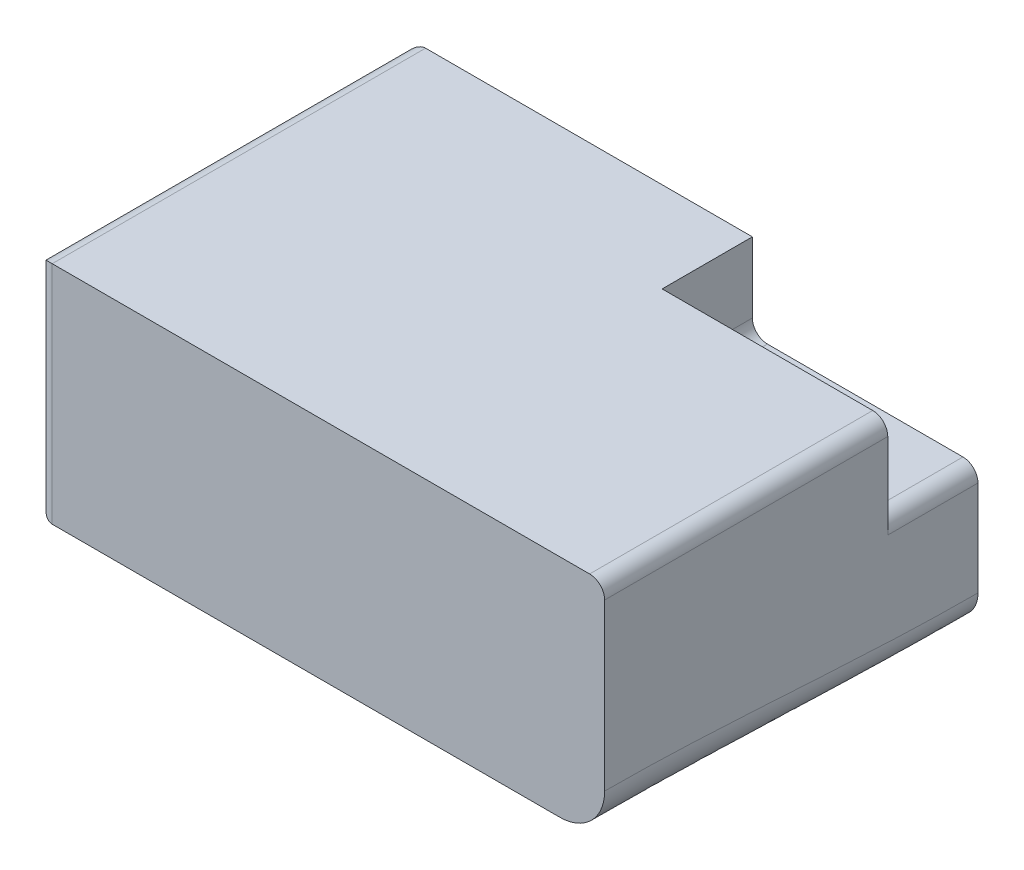
ISO-10303-21;
HEADER;
FILE_DESCRIPTION(('STEP AP214'),'2;1');
FILE_NAME('part.step','',(''),(''),'','','');
FILE_SCHEMA(('AUTOMOTIVE_DESIGN { 1 0 10303 214 1 1 1 1 }'));
ENDSEC;
DATA;
#1=APPLICATION_CONTEXT('core data for automotive mechanical design processes');
#2=APPLICATION_PROTOCOL_DEFINITION('international standard','automotive_design',2000,#1);
#3=PRODUCT_CONTEXT('',#1,'mechanical');
#4=PRODUCT('Part','Part','',(#3));
#5=PRODUCT_RELATED_PRODUCT_CATEGORY('part','',(#4));
#6=PRODUCT_DEFINITION_FORMATION('','',#4);
#7=PRODUCT_DEFINITION_CONTEXT('part definition',#1,'design');
#8=PRODUCT_DEFINITION('design','',#6,#7);
#9=PRODUCT_DEFINITION_SHAPE('','',#8);
#10=(LENGTH_UNIT() NAMED_UNIT(*) SI_UNIT(.MILLI.,.METRE.));
#11=(NAMED_UNIT(*) PLANE_ANGLE_UNIT() SI_UNIT($,.RADIAN.));
#12=(NAMED_UNIT(*) SI_UNIT($,.STERADIAN.) SOLID_ANGLE_UNIT());
#13=UNCERTAINTY_MEASURE_WITH_UNIT(LENGTH_MEASURE(1.E-05),#10,'distance_accuracy_value','');
#14=(GEOMETRIC_REPRESENTATION_CONTEXT(3) GLOBAL_UNCERTAINTY_ASSIGNED_CONTEXT((#13)) GLOBAL_UNIT_ASSIGNED_CONTEXT((#10,
#11,#12)) REPRESENTATION_CONTEXT('',''));
#15=CARTESIAN_POINT('',(0.,0.,0.));
#16=DIRECTION('',(0.,0.,1.));
#17=DIRECTION('',(1.,0.,0.));
#18=AXIS2_PLACEMENT_3D('',#15,#16,#17);
#19=CARTESIAN_POINT('',(-35.7250127888998,2.,-24.8190873611183));
#20=DIRECTION('',(0.,0.,1.));
#21=DIRECTION('',(1.,0.,0.));
#22=AXIS2_PLACEMENT_3D('',#19,#20,#21);
#23=CYLINDRICAL_SURFACE('',#22,2.);
#24=CARTESIAN_POINT('',(-35.7250127888998,2.,22.8190873611183));
#25=DIRECTION('',(0.,0.707106781186547,0.707106781186547));
#26=DIRECTION('',(0.,0.707106781186547,-0.707106781186547));
#27=AXIS2_PLACEMENT_3D('',#24,#25,#26);
#28=ELLIPSE('',#27,2.82842712474619,2.);
#29=CARTESIAN_POINT('',(-37.7250127888998,2.,22.8190873611183));
#30=VERTEX_POINT('',#29);
#31=CARTESIAN_POINT('',(-35.7250127888998,0.,24.8190873611183));
#32=VERTEX_POINT('',#31);
#33=EDGE_CURVE('E11',#30,#32,#28,.T.);
#34=ORIENTED_EDGE('',*,*,#33,.F.);
#35=DIRECTION('',(0.,0.,1.));
#36=VECTOR('',#35,1.);
#37=CARTESIAN_POINT('',(-37.7250127888998,2.,-24.8190873611183));
#38=LINE('',#37,#36);
#39=CARTESIAN_POINT('',(-37.7250127888998,2.,-22.8190873611183));
#40=VERTEX_POINT('',#39);
#41=EDGE_CURVE('E295',#40,#30,#38,.T.);
#42=ORIENTED_EDGE('',*,*,#41,.F.);
#43=CARTESIAN_POINT('',(-35.7250127888998,2.,-22.8190873611183));
#44=DIRECTION('',(0.,-0.707106781186547,0.707106781186547));
#45=DIRECTION('',(0.,0.707106781186547,0.707106781186547));
#46=AXIS2_PLACEMENT_3D('',#43,#44,#45);
#47=ELLIPSE('',#46,2.82842712474619,2.);
#48=CARTESIAN_POINT('',(-35.7250127888998,0.,-24.8190873611183));
#49=VERTEX_POINT('',#48);
#50=EDGE_CURVE('E49',#40,#49,#47,.T.);
#51=ORIENTED_EDGE('',*,*,#50,.T.);
#52=DIRECTION('',(0.,0.,1.));
#53=VECTOR('',#52,1.);
#54=CARTESIAN_POINT('',(-35.7250127888998,0.,0.));
#55=LINE('',#54,#53);
#56=EDGE_CURVE('E296',#32,#49,#55,.F.);
#57=ORIENTED_EDGE('',*,*,#56,.F.);
#58=EDGE_LOOP('',(#34,#42,#51,#57));
#59=FACE_BOUND('',#58,.T.);
#60=ADVANCED_FACE('F41',(#59),#23,.T.);
#61=CARTESIAN_POINT('',(-35.7250127888998,30.,-22.8190873611183));
#62=DIRECTION('',(0.,-1.,0.));
#63=DIRECTION('',(0.,0.,-1.));
#64=AXIS2_PLACEMENT_3D('',#61,#62,#63);
#65=CYLINDRICAL_SURFACE('',#64,2.);
#66=ORIENTED_EDGE('',*,*,#50,.F.);
#67=DIRECTION('',(0.,-1.,0.));
#68=VECTOR('',#67,1.);
#69=CARTESIAN_POINT('',(-37.7250127888998,30.,-22.8190873611183));
#70=LINE('',#69,#68);
#71=CARTESIAN_POINT('',(-37.7250127888998,28.,-22.8190873611183));
#72=VERTEX_POINT('',#71);
#73=EDGE_CURVE('E311',#72,#40,#70,.T.);
#74=ORIENTED_EDGE('',*,*,#73,.F.);
#75=CARTESIAN_POINT('',(-35.7250127888998,28.,-22.8190873611183));
#76=DIRECTION('',(0.,-0.707106781186547,-0.707106781186547));
#77=DIRECTION('',(0.,-0.707106781186547,0.707106781186547));
#78=AXIS2_PLACEMENT_3D('',#75,#76,#77);
#79=ELLIPSE('',#78,2.82842712474619,2.);
#80=CARTESIAN_POINT('',(-35.7250127888998,30.,-24.8190873611183));
#81=VERTEX_POINT('',#80);
#82=EDGE_CURVE('E63',#72,#81,#79,.T.);
#83=ORIENTED_EDGE('',*,*,#82,.T.);
#84=DIRECTION('',(0.,-1.,0.));
#85=VECTOR('',#84,1.);
#86=CARTESIAN_POINT('',(-35.7250127888998,30.,-24.8190873611183));
#87=LINE('',#86,#85);
#88=EDGE_CURVE('E331',#49,#81,#87,.F.);
#89=ORIENTED_EDGE('',*,*,#88,.F.);
#90=EDGE_LOOP('',(#66,#74,#83,#89));
#91=FACE_BOUND('',#90,.T.);
#92=ADVANCED_FACE('F288',(#91),#65,.T.);
#93=CARTESIAN_POINT('',(-35.7250127888998,28.,-24.8190873611183));
#94=DIRECTION('',(0.,0.,1.));
#95=DIRECTION('',(1.,0.,0.));
#96=AXIS2_PLACEMENT_3D('',#93,#94,#95);
#97=CYLINDRICAL_SURFACE('',#96,2.);
#98=ORIENTED_EDGE('',*,*,#82,.F.);
#99=DIRECTION('',(0.,0.,-1.));
#100=VECTOR('',#99,1.);
#101=CARTESIAN_POINT('',(-37.7250127888998,28.,-24.8190873611183));
#102=LINE('',#101,#100);
#103=CARTESIAN_POINT('',(-37.7250127888998,28.,22.8190873611183));
#104=VERTEX_POINT('',#103);
#105=EDGE_CURVE('E308',#104,#72,#102,.T.);
#106=ORIENTED_EDGE('',*,*,#105,.F.);
#107=CARTESIAN_POINT('',(-35.7250127888998,28.,22.8190873611183));
#108=DIRECTION('',(0.,-0.707106781186547,0.707106781186547));
#109=DIRECTION('',(0.,0.707106781186547,0.707106781186547));
#110=AXIS2_PLACEMENT_3D('',#107,#108,#109);
#111=ELLIPSE('',#110,2.82842712474619,2.);
#112=CARTESIAN_POINT('',(-35.7250127888998,30.,24.8190873611183));
#113=VERTEX_POINT('',#112);
#114=EDGE_CURVE('E302',#104,#113,#111,.F.);
#115=ORIENTED_EDGE('',*,*,#114,.T.);
#116=DIRECTION('',(0.,0.,-1.));
#117=VECTOR('',#116,1.);
#118=CARTESIAN_POINT('',(-35.7250127888998,30.,-24.8190873611183));
#119=LINE('',#118,#117);
#120=EDGE_CURVE('E327',#81,#113,#119,.F.);
#121=ORIENTED_EDGE('',*,*,#120,.F.);
#122=EDGE_LOOP('',(#98,#106,#115,#121));
#123=FACE_BOUND('',#122,.T.);
#124=ADVANCED_FACE('F292',(#123),#97,.T.);
#125=CARTESIAN_POINT('',(-35.7250127888998,30.,22.8190873611183));
#126=DIRECTION('',(0.,1.,0.));
#127=DIRECTION('',(0.,0.,1.));
#128=AXIS2_PLACEMENT_3D('',#125,#126,#127);
#129=CYLINDRICAL_SURFACE('',#128,2.);
#130=DIRECTION('',(0.,1.,0.));
#131=VECTOR('',#130,1.);
#132=CARTESIAN_POINT('',(-37.7250127888998,30.,22.8190873611183));
#133=LINE('',#132,#131);
#134=EDGE_CURVE('E301',#30,#104,#133,.T.);
#135=ORIENTED_EDGE('',*,*,#134,.F.);
#136=ORIENTED_EDGE('',*,*,#33,.T.);
#137=DIRECTION('',(0.,1.,0.));
#138=VECTOR('',#137,1.);
#139=CARTESIAN_POINT('',(-35.7250127888998,30.,24.8190873611183));
#140=LINE('',#139,#138);
#141=EDGE_CURVE('E307',#113,#32,#140,.F.);
#142=ORIENTED_EDGE('',*,*,#141,.F.);
#143=ORIENTED_EDGE('',*,*,#114,.F.);
#144=EDGE_LOOP('',(#135,#136,#142,#143));
#145=FACE_BOUND('',#144,.T.);
#146=ADVANCED_FACE('F270',(#145),#129,.T.);
#147=CARTESIAN_POINT('',(37.7250127888998,30.,-24.8190873611183));
#148=DIRECTION('',(-1.,0.,0.));
#149=DIRECTION('',(0.,0.,1.));
#150=AXIS2_PLACEMENT_3D('',#147,#148,#149);
#151=PLANE('',#150);
#152=DIRECTION('',(0.,-1.,0.));
#153=VECTOR('',#152,1.);
#154=CARTESIAN_POINT('',(37.7250127888998,30.,24.8190873611183));
#155=LINE('',#154,#153);
#156=CARTESIAN_POINT('',(37.7250127888998,28.,24.8190873611183));
#157=VERTEX_POINT('',#156);
#158=CARTESIAN_POINT('',(37.7250127888998,6.,24.8190873611183));
#159=VERTEX_POINT('',#158);
#160=EDGE_CURVE('E179',#157,#159,#155,.T.);
#161=ORIENTED_EDGE('',*,*,#160,.T.);
#162=CARTESIAN_POINT('',(37.7250127888998,6.,124.095436805591));
#163=CARTESIAN_POINT('',(37.7250127888998,6.,91.0033203241004));
#164=CARTESIAN_POINT('',(37.7250127888998,6.,57.9112038426094));
#165=CARTESIAN_POINT('',(37.7250127888998,6.,24.8190873611183));
#166=CARTESIAN_POINT('',(37.7250127888998,6.,8.27302912037277));
#167=CARTESIAN_POINT('',(37.7250127888998,4.,-8.27302912037276));
#168=CARTESIAN_POINT('',(37.7250127888998,4.,-24.8190873611183));
#169=CARTESIAN_POINT('',(37.7250127888998,4.,-57.9112038426094));
#170=CARTESIAN_POINT('',(37.7250127888998,4.,-91.0033203241004));
#171=CARTESIAN_POINT('',(37.7250127888998,4.,-124.095436805591));
#172=(BOUNDED_CURVE() B_SPLINE_CURVE(3,(#162,#163,#164,#165,#166,#167,#168,#169,#170,#171),
.UNSPECIFIED.,.F.,.F.) B_SPLINE_CURVE_WITH_KNOTS((4,3,3,4),(-0.14891452416671,
-0.0496381747222366,0.,0.0992763494444732),
.UNSPECIFIED.) CURVE() GEOMETRIC_REPRESENTATION_ITEM() RATIONAL_B_SPLINE_CURVE((1.,1.,1.,1.,1.,
1.,1.,1.,1.,1.)) REPRESENTATION_ITEM(''));
#173=CARTESIAN_POINT('',(37.7250127888998,4.,-24.8190873611183));
#174=VERTEX_POINT('',#173);
#175=EDGE_CURVE('E230',#159,#174,#172,.T.);
#176=ORIENTED_EDGE('',*,*,#175,.T.);
#177=DIRECTION('',(0.,-1.,0.));
#178=VECTOR('',#177,1.);
#179=CARTESIAN_POINT('',(37.7250127888998,30.,-24.8190873611183));
#180=LINE('',#179,#178);
#181=CARTESIAN_POINT('',(37.7250127888998,16.6534981489113,-24.8190873611183));
#182=VERTEX_POINT('',#181);
#183=EDGE_CURVE('E189',#182,#174,#180,.T.);
#184=ORIENTED_EDGE('',*,*,#183,.F.);
#185=DIRECTION('',(0.,0.,-1.));
#186=VECTOR('',#185,1.);
#187=CARTESIAN_POINT('',(37.7250127888998,16.6534981489113,-24.8190873611183));
#188=LINE('',#187,#186);
#189=CARTESIAN_POINT('',(37.7250127888998,16.6534981489113,-12.822392601909));
#190=VERTEX_POINT('',#189);
#191=EDGE_CURVE('E200',#182,#190,#188,.F.);
#192=ORIENTED_EDGE('',*,*,#191,.T.);
#193=DIRECTION('',(0.,-1.,0.));
#194=VECTOR('',#193,1.);
#195=CARTESIAN_POINT('',(37.7250127888998,30.,-12.822392601909));
#196=LINE('',#195,#194);
#197=CARTESIAN_POINT('',(37.7250127888998,28.,-12.822392601909));
#198=VERTEX_POINT('',#197);
#199=EDGE_CURVE('E350',#198,#190,#196,.T.);
#200=ORIENTED_EDGE('',*,*,#199,.F.);
#201=DIRECTION('',(0.,0.,-1.));
#202=VECTOR('',#201,1.);
#203=CARTESIAN_POINT('',(37.7250127888998,28.,24.8190873611183));
#204=LINE('',#203,#202);
#205=EDGE_CURVE('E204',#198,#157,#204,.F.);
#206=ORIENTED_EDGE('',*,*,#205,.T.);
#207=EDGE_LOOP('',(#161,#176,#184,#192,#200,#206));
#208=FACE_BOUND('',#207,.T.);
#209=ADVANCED_FACE('F265',(#208),#151,.F.);
#210=CARTESIAN_POINT('',(-37.7250127888998,30.,-24.8190873611183));
#211=DIRECTION('',(0.,0.,1.));
#212=DIRECTION('',(1.,0.,0.));
#213=AXIS2_PLACEMENT_3D('',#210,#211,#212);
#214=PLANE('',#213);
#215=DIRECTION('',(-1.,0.,0.));
#216=VECTOR('',#215,1.);
#217=CARTESIAN_POINT('',(-37.7250127888998,0.,-24.8190873611183));
#218=LINE('',#217,#216);
#219=CARTESIAN_POINT('',(33.7250127888997,0.,-24.8190873611183));
#220=VERTEX_POINT('',#219);
#221=EDGE_CURVE('E180',#220,#49,#218,.T.);
#222=ORIENTED_EDGE('',*,*,#221,.T.);
#223=ORIENTED_EDGE('',*,*,#88,.T.);
#224=DIRECTION('',(-1.,0.,0.));
#225=VECTOR('',#224,1.);
#226=CARTESIAN_POINT('',(-37.7250127888998,30.,-24.8190873611183));
#227=LINE('',#226,#225);
#228=CARTESIAN_POINT('',(7.72501278889977,30.,-24.8190873611183));
#229=VERTEX_POINT('',#228);
#230=EDGE_CURVE('E172',#229,#81,#227,.T.);
#231=ORIENTED_EDGE('',*,*,#230,.F.);
#232=DIRECTION('',(0.,1.,0.));
#233=VECTOR('',#232,1.);
#234=CARTESIAN_POINT('',(7.72501278889978,30.,-24.8190873611183));
#235=LINE('',#234,#233);
#236=CARTESIAN_POINT('',(7.72501278889978,20.6534981489113,-24.8190873611183));
#237=VERTEX_POINT('',#236);
#238=EDGE_CURVE('E153',#237,#229,#235,.T.);
#239=ORIENTED_EDGE('',*,*,#238,.F.);
#240=CARTESIAN_POINT('',(9.72501278889978,20.6534981489113,-24.8190873611183));
#241=DIRECTION('',(0.,0.,1.));
#242=DIRECTION('',(1.,0.,0.));
#243=AXIS2_PLACEMENT_3D('',#240,#241,#242);
#244=CIRCLE('',#243,2.);
#245=CARTESIAN_POINT('',(9.72501278889978,18.6534981489113,-24.8190873611183));
#246=VERTEX_POINT('',#245);
#247=EDGE_CURVE('E224',#237,#246,#244,.T.);
#248=ORIENTED_EDGE('',*,*,#247,.T.);
#249=DIRECTION('',(1.,0.,0.));
#250=VECTOR('',#249,1.);
#251=CARTESIAN_POINT('',(7.72501278889978,18.6534981489113,-24.8190873611183));
#252=LINE('',#251,#250);
#253=CARTESIAN_POINT('',(35.7250127888998,18.6534981489113,-24.8190873611183));
#254=VERTEX_POINT('',#253);
#255=EDGE_CURVE('E168',#246,#254,#252,.T.);
#256=ORIENTED_EDGE('',*,*,#255,.T.);
#257=CARTESIAN_POINT('',(35.7250127888998,16.6534981489113,-24.8190873611183));
#258=DIRECTION('',(0.,0.,1.));
#259=DIRECTION('',(1.,0.,0.));
#260=AXIS2_PLACEMENT_3D('',#257,#258,#259);
#261=CIRCLE('',#260,2.);
#262=EDGE_CURVE('E221',#254,#182,#261,.F.);
#263=ORIENTED_EDGE('',*,*,#262,.T.);
#264=ORIENTED_EDGE('',*,*,#183,.T.);
#265=CARTESIAN_POINT('',(37.7250127888998,4.,-24.8190873611183));
#266=CARTESIAN_POINT('',(37.7250235690648,3.88749351533069,-24.8190873611183));
#267=CARTESIAN_POINT('',(37.7202661867363,3.77499214031857,-24.8190873611183));
#268=CARTESIAN_POINT('',(37.7012985212358,3.55079431915907,-24.8190873611183));
#269=CARTESIAN_POINT('',(37.6870886915152,3.43909783465941,-24.8190873611183));
#270=CARTESIAN_POINT('',(37.6493138175425,3.21737735873569,-24.8190873611183));
#271=CARTESIAN_POINT('',(37.6257558503689,3.10735216732034,-24.8190873611183));
#272=CARTESIAN_POINT('',(37.5694757924519,2.88970424637513,-24.8190873611183));
#273=CARTESIAN_POINT('',(37.5367538135753,2.78208148753564,-24.8190873611183));
#274=CARTESIAN_POINT('',(37.4251061960667,2.46385527614969,-24.8190873611183));
#275=CARTESIAN_POINT('',(37.3326834221294,2.25780366012309,-24.8190873611183));
#276=CARTESIAN_POINT('',(37.1146177734833,1.86429305281759,-24.8190873611183));
#277=CARTESIAN_POINT('',(36.9889807509186,1.67683079420276,-24.8190873611183));
#278=CARTESIAN_POINT('',(36.7080109778778,1.32562841968199,-24.8190873611183));
#279=CARTESIAN_POINT('',(36.5526785172083,1.16188807229434,-24.8190873611183));
#280=CARTESIAN_POINT('',(36.2166954634305,0.862784943115784,-24.8190873611183));
#281=CARTESIAN_POINT('',(36.0360399233567,0.72742771900899,-24.8190873611183));
#282=CARTESIAN_POINT('',(35.6545496714366,0.488943692525059,-24.8190873611183));
#283=CARTESIAN_POINT('',(35.4537110191452,0.385823200096089,-24.8190873611183));
#284=CARTESIAN_POINT('',(35.0376115317056,0.214817855130698,-24.8190873611183));
#285=CARTESIAN_POINT('',(34.8223592272636,0.14691236514982,-24.8190873611183));
#286=CARTESIAN_POINT('',(34.4589935278413,0.0651394785829505,-24.8190873611183));
#287=CARTESIAN_POINT('',(34.3131659777866,0.0407269308072323,-24.8190873611183));
#288=CARTESIAN_POINT('',(34.0199169233531,0.00815932773058816,-24.8190873611183));
#289=CARTESIAN_POINT('',(33.8724979778582,-1.87754480872407E-05,-24.8190873611183));
#290=CARTESIAN_POINT('',(33.7250127888998,0.,-24.8190873611183));
#291=B_SPLINE_CURVE_WITH_KNOTS('',3,(#265,#266,#267,#268,#269,#270,#271,#272,#273,#274,#275,
#276,#277,#278,#279,#280,#281,#282,#283,#284,#285,#286,#287,#288,#289,#290),.UNSPECIFIED.,.F.,
.F.,(4,2,2,2,2,2,2,2,2,2,2,2,4),(0.,0.337409690213688,0.674803195430497,1.0119417601582,
1.34907620955064,2.02307394016271,2.69695299561843,3.37082547482513,4.04482978167748,
4.71896593419017,5.39270656736783,5.83543557899262,6.27753560189516),.UNSPECIFIED.);
#292=EDGE_CURVE('E236',#174,#220,#291,.T.);
#293=ORIENTED_EDGE('',*,*,#292,.T.);
#294=EDGE_LOOP('',(#222,#223,#231,#239,#248,#256,#263,#264,#293));
#295=FACE_BOUND('',#294,.T.);
#296=ADVANCED_FACE('F259',(#295),#214,.F.);
#297=CARTESIAN_POINT('',(-37.7250127888998,30.,-24.8190873611183));
#298=DIRECTION('',(1.,0.,0.));
#299=DIRECTION('',(0.,0.,-1.));
#300=AXIS2_PLACEMENT_3D('',#297,#298,#299);
#301=PLANE('',#300);
#302=ORIENTED_EDGE('',*,*,#41,.T.);
#303=ORIENTED_EDGE('',*,*,#134,.T.);
#304=ORIENTED_EDGE('',*,*,#105,.T.);
#305=ORIENTED_EDGE('',*,*,#73,.T.);
#306=EDGE_LOOP('',(#302,#303,#304,#305));
#307=FACE_BOUND('',#306,.T.);
#308=ADVANCED_FACE('F264',(#307),#301,.F.);
#309=CARTESIAN_POINT('',(-37.7250127888998,30.,24.8190873611183));
#310=DIRECTION('',(0.,0.,-1.));
#311=DIRECTION('',(-1.,0.,0.));
#312=AXIS2_PLACEMENT_3D('',#309,#310,#311);
#313=PLANE('',#312);
#314=DIRECTION('',(1.,0.,0.));
#315=VECTOR('',#314,1.);
#316=CARTESIAN_POINT('',(-37.7250127888998,30.,24.8190873611183));
#317=LINE('',#316,#315);
#318=CARTESIAN_POINT('',(35.7250127888998,30.,24.8190873611183));
#319=VERTEX_POINT('',#318);
#320=EDGE_CURVE('E175',#113,#319,#317,.T.);
#321=ORIENTED_EDGE('',*,*,#320,.F.);
#322=ORIENTED_EDGE('',*,*,#141,.T.);
#323=DIRECTION('',(1.,0.,0.));
#324=VECTOR('',#323,1.);
#325=CARTESIAN_POINT('',(-37.7250127888998,0.,24.8190873611183));
#326=LINE('',#325,#324);
#327=CARTESIAN_POINT('',(31.7250127888997,0.,24.8190873611183));
#328=VERTEX_POINT('',#327);
#329=EDGE_CURVE('E176',#32,#328,#326,.T.);
#330=ORIENTED_EDGE('',*,*,#329,.T.);
#331=CARTESIAN_POINT('',(31.7250127888998,0.,24.8190873611183));
#332=CARTESIAN_POINT('',(31.8950090753637,-1.86981098160291E-05,24.8190873611183));
#333=CARTESIAN_POINT('',(32.0650027038107,0.00722389432381613,24.8190873611183));
#334=CARTESIAN_POINT('',(32.4037567317991,0.0360967450756497,24.8190873611183));
#335=CARTESIAN_POINT('',(32.5725171842009,0.0577263829883865,24.8190873611183));
#336=CARTESIAN_POINT('',(32.9074538581873,0.115214751694605,24.8190873611183));
#337=CARTESIAN_POINT('',(33.0736320933437,0.151061750761233,24.8190873611183));
#338=CARTESIAN_POINT('',(33.4023464178071,0.23672016459499,24.8190873611183));
#339=CARTESIAN_POINT('',(33.5648825775773,0.286531308945623,24.8190873611183));
#340=CARTESIAN_POINT('',(33.8840364529563,0.399368969482682,24.8190873611183));
#341=CARTESIAN_POINT('',(34.0406873053109,0.462301784937403,24.8190873611183));
#342=CARTESIAN_POINT('',(34.3481877246997,0.601164664992711,24.8190873611183));
#343=CARTESIAN_POINT('',(34.4990351497532,0.677099473178297,24.8190873611183));
#344=CARTESIAN_POINT('',(34.7937139897086,0.841365267601108,24.8190873611183));
#345=CARTESIAN_POINT('',(34.9375491965755,0.929689451606835,24.8190873611183));
#346=CARTESIAN_POINT('',(35.2173186592951,1.11817057602724,24.8190873611183));
#347=CARTESIAN_POINT('',(35.3532501523555,1.21833161742792,24.8190873611183));
#348=CARTESIAN_POINT('',(35.6161676151901,1.42973055676803,24.8190873611183));
#349=CARTESIAN_POINT('',(35.7431551964889,1.54096645046462,24.8190873611183));
#350=CARTESIAN_POINT('',(35.987309250363,1.77373953402339,24.8190873611183));
#351=CARTESIAN_POINT('',(36.1044757219395,1.89527672493306,24.8190873611183));
#352=CARTESIAN_POINT('',(36.3281970423648,2.14783635072488,24.8190873611183));
#353=CARTESIAN_POINT('',(36.4347478642595,2.27886235280264,24.8190873611183));
#354=CARTESIAN_POINT('',(36.6363945260115,2.54937975362475,24.8190873611183));
#355=CARTESIAN_POINT('',(36.731494327303,2.68886819956207,24.8190873611183));
#356=CARTESIAN_POINT('',(36.9096555969771,2.97544047568537,24.8190873611183));
#357=CARTESIAN_POINT('',(36.992710334508,3.12252849077099,24.8190873611183));
#358=CARTESIAN_POINT('',(37.1460992128019,3.42312487051135,24.8190873611183));
#359=CARTESIAN_POINT('',(37.2164379697274,3.57663088028415,24.8190873611183));
#360=CARTESIAN_POINT('',(37.3439132577485,3.8889822852421,24.8190873611183));
#361=CARTESIAN_POINT('',(37.401053767419,4.04782605479193,24.8190873611183));
#362=CARTESIAN_POINT('',(37.5017390128953,4.36969946546279,24.8190873611183));
#363=CARTESIAN_POINT('',(37.5452870862561,4.5327280683617,24.8190873611183));
#364=CARTESIAN_POINT('',(37.629438543733,4.91111853425652,24.8190873611183));
#365=CARTESIAN_POINT('',(37.6652788005319,5.1275695856273,24.8190873611183));
#366=CARTESIAN_POINT('',(37.70111557847,5.45393975330492,24.8190873611183));
#367=CARTESIAN_POINT('',(37.7100738953551,5.56295485118783,24.8190873611183));
#368=CARTESIAN_POINT('',(37.7220218016125,5.78130460515677,24.8190873611183));
#369=CARTESIAN_POINT('',(37.7250117772377,5.89063924010468,24.8190873611183));
#370=CARTESIAN_POINT('',(37.7250127888998,6.,24.8190873611183));
#371=B_SPLINE_CURVE_WITH_KNOTS('',3,(#331,#332,#333,#334,#335,#336,#337,#338,#339,#340,#341,
#342,#343,#344,#345,#346,#347,#348,#349,#350,#351,#352,#353,#354,#355,#356,#357,#358,#359,#360,
#361,#362,#363,#364,#365,#366,#367,#368,#369,#370),.UNSPECIFIED.,.F.,.F.,(4,2,2,2,2,2,2,2,2,2,2,
2,2,2,2,2,2,2,2,4),(0.,0.509830924370315,1.01963986497838,1.52902899934311,2.0384082700386,
2.54426757885661,3.05031183774829,3.55607933902142,4.06202258456971,4.56787443420239,
5.07372633527276,5.57976940200125,6.08563689912853,6.59178599765099,7.0977509830461,
7.60356324706811,8.10925121352409,8.76595527395685,9.09396577844668,9.42195505440725),.UNSPECIFIED.);
#372=EDGE_CURVE('E313',#328,#159,#371,.T.);
#373=ORIENTED_EDGE('',*,*,#372,.T.);
#374=ORIENTED_EDGE('',*,*,#160,.F.);
#375=CARTESIAN_POINT('',(35.7250127888998,28.,24.8190873611183));
#376=DIRECTION('',(0.,0.,-1.));
#377=DIRECTION('',(-1.,0.,0.));
#378=AXIS2_PLACEMENT_3D('',#375,#376,#377);
#379=CIRCLE('',#378,2.);
#380=EDGE_CURVE('E207',#157,#319,#379,.F.);
#381=ORIENTED_EDGE('',*,*,#380,.T.);
#382=EDGE_LOOP('',(#321,#322,#330,#373,#374,#381));
#383=FACE_BOUND('',#382,.T.);
#384=ADVANCED_FACE('F345',(#383),#313,.F.);
#385=CARTESIAN_POINT('',(0.,30.,0.));
#386=DIRECTION('',(0.,1.,0.));
#387=DIRECTION('',(0.,0.,1.));
#388=AXIS2_PLACEMENT_3D('',#385,#386,#387);
#389=PLANE('',#388);
#390=ORIENTED_EDGE('',*,*,#230,.T.);
#391=ORIENTED_EDGE('',*,*,#120,.T.);
#392=ORIENTED_EDGE('',*,*,#320,.T.);
#393=DIRECTION('',(0.,0.,-1.));
#394=VECTOR('',#393,1.);
#395=CARTESIAN_POINT('',(35.7250127888998,30.,-12.822392601909));
#396=LINE('',#395,#394);
#397=CARTESIAN_POINT('',(35.7250127888998,30.,-12.822392601909));
#398=VERTEX_POINT('',#397);
#399=EDGE_CURVE('E162',#319,#398,#396,.T.);
#400=ORIENTED_EDGE('',*,*,#399,.T.);
#401=DIRECTION('',(1.,0.,0.));
#402=VECTOR('',#401,1.);
#403=CARTESIAN_POINT('',(7.72501278889978,30.,-12.822392601909));
#404=LINE('',#403,#402);
#405=CARTESIAN_POINT('',(7.72501278889978,30.,-12.822392601909));
#406=VERTEX_POINT('',#405);
#407=EDGE_CURVE('E140',#406,#398,#404,.T.);
#408=ORIENTED_EDGE('',*,*,#407,.F.);
#409=DIRECTION('',(0.,0.,1.));
#410=VECTOR('',#409,1.);
#411=CARTESIAN_POINT('',(7.72501278889978,30.,-24.8190873611183));
#412=LINE('',#411,#410);
#413=EDGE_CURVE('E148',#229,#406,#412,.T.);
#414=ORIENTED_EDGE('',*,*,#413,.F.);
#415=EDGE_LOOP('',(#390,#391,#392,#400,#408,#414));
#416=FACE_BOUND('',#415,.T.);
#417=ADVANCED_FACE('F160',(#416),#389,.T.);
#418=CARTESIAN_POINT('',(0.,0.,0.));
#419=DIRECTION('',(0.,1.,0.));
#420=DIRECTION('',(0.,0.,1.));
#421=AXIS2_PLACEMENT_3D('',#418,#419,#420);
#422=PLANE('',#421);
#423=ORIENTED_EDGE('',*,*,#329,.F.);
#424=ORIENTED_EDGE('',*,*,#56,.T.);
#425=ORIENTED_EDGE('',*,*,#221,.F.);
#426=CARTESIAN_POINT('',(31.7250127888998,0.,124.095436805591));
#427=CARTESIAN_POINT('',(31.7250127888998,0.,91.0033203241004));
#428=CARTESIAN_POINT('',(31.7250127888998,0.,57.9112038426094));
#429=CARTESIAN_POINT('',(31.7250127888998,0.,24.8190873611183));
#430=CARTESIAN_POINT('',(31.7250127888998,0.,8.27302912037277));
#431=CARTESIAN_POINT('',(33.7250127888998,0.,-8.27302912037276));
#432=CARTESIAN_POINT('',(33.7250127888998,0.,-24.8190873611183));
#433=CARTESIAN_POINT('',(33.7250127888998,0.,-57.9112038426094));
#434=CARTESIAN_POINT('',(33.7250127888998,0.,-91.0033203241004));
#435=CARTESIAN_POINT('',(33.7250127888998,0.,-124.095436805591));
#436=(BOUNDED_CURVE() B_SPLINE_CURVE(3,(#426,#427,#428,#429,#430,#431,#432,#433,#434,#435),
.UNSPECIFIED.,.F.,.F.) B_SPLINE_CURVE_WITH_KNOTS((4,3,3,4),(-0.14891452416671,
-0.0496381747222366,0.,0.0992763494444732),
.UNSPECIFIED.) CURVE() GEOMETRIC_REPRESENTATION_ITEM() RATIONAL_B_SPLINE_CURVE((1.,1.,1.,1.,1.,
1.,1.,1.,1.,1.)) REPRESENTATION_ITEM(''));
#437=EDGE_CURVE('E248',#220,#328,#436,.F.);
#438=ORIENTED_EDGE('',*,*,#437,.T.);
#439=EDGE_LOOP('',(#423,#424,#425,#438));
#440=FACE_BOUND('',#439,.T.);
#441=ADVANCED_FACE('F368',(#440),#422,.F.);
#442=CARTESIAN_POINT('',(7.72501278889978,18.6534981489113,-24.8190873611183));
#443=DIRECTION('',(0.,-1.,0.));
#444=DIRECTION('',(0.,0.,-1.));
#445=AXIS2_PLACEMENT_3D('',#442,#443,#444);
#446=PLANE('',#445);
#447=ORIENTED_EDGE('',*,*,#255,.F.);
#448=DIRECTION('',(0.,0.,-1.));
#449=VECTOR('',#448,1.);
#450=CARTESIAN_POINT('',(9.72501278889978,18.6534981489113,-12.822392601909));
#451=LINE('',#450,#449);
#452=CARTESIAN_POINT('',(9.72501278889978,18.6534981489113,-12.822392601909));
#453=VERTEX_POINT('',#452);
#454=EDGE_CURVE('E218',#246,#453,#451,.F.);
#455=ORIENTED_EDGE('',*,*,#454,.T.);
#456=DIRECTION('',(1.,0.,0.));
#457=VECTOR('',#456,1.);
#458=CARTESIAN_POINT('',(7.72501278889978,18.6534981489113,-12.822392601909));
#459=LINE('',#458,#457);
#460=CARTESIAN_POINT('',(35.7250127888998,18.6534981489113,-12.822392601909));
#461=VERTEX_POINT('',#460);
#462=EDGE_CURVE('E164',#453,#461,#459,.T.);
#463=ORIENTED_EDGE('',*,*,#462,.T.);
#464=DIRECTION('',(0.,0.,-1.));
#465=VECTOR('',#464,1.);
#466=CARTESIAN_POINT('',(35.7250127888998,18.6534981489113,-24.8190873611183));
#467=LINE('',#466,#465);
#468=EDGE_CURVE('E214',#461,#254,#467,.T.);
#469=ORIENTED_EDGE('',*,*,#468,.T.);
#470=EDGE_LOOP('',(#447,#455,#463,#469));
#471=FACE_BOUND('',#470,.T.);
#472=ADVANCED_FACE('F362',(#471),#446,.F.);
#473=CARTESIAN_POINT('',(7.72501278889978,30.,-12.822392601909));
#474=DIRECTION('',(0.,0.,1.));
#475=DIRECTION('',(1.,0.,0.));
#476=AXIS2_PLACEMENT_3D('',#473,#474,#475);
#477=PLANE('',#476);
#478=ORIENTED_EDGE('',*,*,#407,.T.);
#479=CARTESIAN_POINT('',(35.7250127888998,28.,-12.822392601909));
#480=DIRECTION('',(0.,0.,1.));
#481=DIRECTION('',(1.,0.,0.));
#482=AXIS2_PLACEMENT_3D('',#479,#480,#481);
#483=CIRCLE('',#482,2.);
#484=EDGE_CURVE('E197',#398,#198,#483,.F.);
#485=ORIENTED_EDGE('',*,*,#484,.T.);
#486=ORIENTED_EDGE('',*,*,#199,.T.);
#487=CARTESIAN_POINT('',(35.7250127888998,16.6534981489113,-12.822392601909));
#488=DIRECTION('',(0.,0.,1.));
#489=DIRECTION('',(1.,0.,0.));
#490=AXIS2_PLACEMENT_3D('',#487,#488,#489);
#491=CIRCLE('',#490,2.);
#492=EDGE_CURVE('E227',#190,#461,#491,.T.);
#493=ORIENTED_EDGE('',*,*,#492,.T.);
#494=ORIENTED_EDGE('',*,*,#462,.F.);
#495=CARTESIAN_POINT('',(9.72501278889978,20.6534981489113,-12.822392601909));
#496=DIRECTION('',(0.,0.,1.));
#497=DIRECTION('',(1.,0.,0.));
#498=AXIS2_PLACEMENT_3D('',#495,#496,#497);
#499=CIRCLE('',#498,2.);
#500=CARTESIAN_POINT('',(7.72501278889978,20.6534981489113,-12.822392601909));
#501=VERTEX_POINT('',#500);
#502=EDGE_CURVE('E143',#453,#501,#499,.F.);
#503=ORIENTED_EDGE('',*,*,#502,.T.);
#504=DIRECTION('',(0.,-1.,0.));
#505=VECTOR('',#504,1.);
#506=CARTESIAN_POINT('',(7.72501278889978,30.,-12.822392601909));
#507=LINE('',#506,#505);
#508=EDGE_CURVE('E136',#406,#501,#507,.T.);
#509=ORIENTED_EDGE('',*,*,#508,.F.);
#510=EDGE_LOOP('',(#478,#485,#486,#493,#494,#503,#509));
#511=FACE_BOUND('',#510,.T.);
#512=ADVANCED_FACE('F138',(#511),#477,.F.);
#513=CARTESIAN_POINT('',(7.72501278889978,0.,0.));
#514=DIRECTION('',(-1.,0.,0.));
#515=DIRECTION('',(0.,0.,1.));
#516=AXIS2_PLACEMENT_3D('',#513,#514,#515);
#517=PLANE('',#516);
#518=ORIENTED_EDGE('',*,*,#508,.T.);
#519=DIRECTION('',(0.,0.,-1.));
#520=VECTOR('',#519,1.);
#521=CARTESIAN_POINT('',(7.72501278889978,20.6534981489113,-24.8190873611183));
#522=LINE('',#521,#520);
#523=EDGE_CURVE('E211',#501,#237,#522,.T.);
#524=ORIENTED_EDGE('',*,*,#523,.T.);
#525=ORIENTED_EDGE('',*,*,#238,.T.);
#526=ORIENTED_EDGE('',*,*,#413,.T.);
#527=EDGE_LOOP('',(#518,#524,#525,#526));
#528=FACE_BOUND('',#527,.T.);
#529=ADVANCED_FACE('F151',(#528),#517,.F.);
#530=CARTESIAN_POINT('',(35.7250127888998,28.,0.));
#531=DIRECTION('',(0.,0.,1.));
#532=DIRECTION('',(1.,0.,0.));
#533=AXIS2_PLACEMENT_3D('',#530,#531,#532);
#534=CYLINDRICAL_SURFACE('',#533,2.);
#535=ORIENTED_EDGE('',*,*,#380,.F.);
#536=ORIENTED_EDGE('',*,*,#205,.F.);
#537=ORIENTED_EDGE('',*,*,#484,.F.);
#538=ORIENTED_EDGE('',*,*,#399,.F.);
#539=EDGE_LOOP('',(#535,#536,#537,#538));
#540=FACE_BOUND('',#539,.T.);
#541=ADVANCED_FACE('F272',(#540),#534,.T.);
#542=CARTESIAN_POINT('',(9.72501278889978,20.6534981489113,0.));
#543=DIRECTION('',(0.,0.,1.));
#544=DIRECTION('',(1.,0.,0.));
#545=AXIS2_PLACEMENT_3D('',#542,#543,#544);
#546=CYLINDRICAL_SURFACE('',#545,2.);
#547=ORIENTED_EDGE('',*,*,#502,.F.);
#548=ORIENTED_EDGE('',*,*,#454,.F.);
#549=ORIENTED_EDGE('',*,*,#247,.F.);
#550=ORIENTED_EDGE('',*,*,#523,.F.);
#551=EDGE_LOOP('',(#547,#548,#549,#550));
#552=FACE_BOUND('',#551,.T.);
#553=ADVANCED_FACE('F275',(#552),#546,.F.);
#554=CARTESIAN_POINT('',(35.7250127888998,16.6534981489113,-24.8190873611183));
#555=DIRECTION('',(0.,0.,-1.));
#556=DIRECTION('',(-1.,0.,0.));
#557=AXIS2_PLACEMENT_3D('',#554,#555,#556);
#558=CYLINDRICAL_SURFACE('',#557,2.);
#559=ORIENTED_EDGE('',*,*,#492,.F.);
#560=ORIENTED_EDGE('',*,*,#191,.F.);
#561=ORIENTED_EDGE('',*,*,#262,.F.);
#562=ORIENTED_EDGE('',*,*,#468,.F.);
#563=EDGE_LOOP('',(#559,#560,#561,#562));
#564=FACE_BOUND('',#563,.T.);
#565=ADVANCED_FACE('F278',(#564),#558,.T.);
#566=CARTESIAN_POINT('',(37.7250127888998,6.,34.7467223055656));
#567=CARTESIAN_POINT('',(37.7250127888998,6.,31.4375106574165));
#568=CARTESIAN_POINT('',(37.7250127888998,6.,28.1282990092674));
#569=CARTESIAN_POINT('',(37.7250127888998,6.,24.8190873611183));
#570=CARTESIAN_POINT('',(37.7250127888998,6.,8.27302912037277));
#571=CARTESIAN_POINT('',(37.7250127888998,4.,-8.27302912037276));
#572=CARTESIAN_POINT('',(37.7250127888998,4.,-24.8190873611183));
#573=CARTESIAN_POINT('',(37.7250127888998,4.,-28.1282990092674));
#574=CARTESIAN_POINT('',(37.7250127888998,4.,-31.4375106574165));
#575=CARTESIAN_POINT('',(37.7250127888998,4.,-34.7467223055656));
#576=CARTESIAN_POINT('',(37.7250127888998,0.,34.7467223055656));
#577=CARTESIAN_POINT('',(37.7250127888998,0.,31.4375106574165));
#578=CARTESIAN_POINT('',(37.7250127888998,0.,28.1282990092674));
#579=CARTESIAN_POINT('',(37.7250127888998,0.,24.8190873611183));
#580=CARTESIAN_POINT('',(37.7250127888998,0.,8.27302912037277));
#581=CARTESIAN_POINT('',(37.7250127888998,0.,-8.27302912037276));
#582=CARTESIAN_POINT('',(37.7250127888998,0.,-24.8190873611183));
#583=CARTESIAN_POINT('',(37.7250127888998,0.,-28.1282990092674));
#584=CARTESIAN_POINT('',(37.7250127888998,0.,-31.4375106574165));
#585=CARTESIAN_POINT('',(37.7250127888998,0.,-34.7467223055656));
#586=CARTESIAN_POINT('',(31.7250127888998,0.,34.7467223055656));
#587=CARTESIAN_POINT('',(31.7250127888998,0.,31.4375106574165));
#588=CARTESIAN_POINT('',(31.7250127888998,0.,28.1282990092674));
#589=CARTESIAN_POINT('',(31.7250127888998,0.,24.8190873611183));
#590=CARTESIAN_POINT('',(31.7250127888998,0.,8.27302912037277));
#591=CARTESIAN_POINT('',(33.7250127888998,0.,-8.27302912037276));
#592=CARTESIAN_POINT('',(33.7250127888998,0.,-24.8190873611183));
#593=CARTESIAN_POINT('',(33.7250127888998,0.,-28.1282990092674));
#594=CARTESIAN_POINT('',(33.7250127888998,0.,-31.4375106574165));
#595=CARTESIAN_POINT('',(33.7250127888998,0.,-34.7467223055656));
#596=(BOUNDED_SURFACE() B_SPLINE_SURFACE(2,3,((#566,#567,#568,#569,#570,#571,#572,#573,#574,
#575),(#576,#577,#578,#579,#580,#581,#582,#583,#584,#585),(#586,#587,#588,#589,#590,#591,#592,
#593,#594,#595)),.UNSPECIFIED.,.F.,.F.,.F.) B_SPLINE_SURFACE_WITH_KNOTS((3,3),(4,3,3,4),(0.,1.),
(-0.0595658096666839,-0.0496381747222366,0.,0.00992763494444731),
.UNSPECIFIED.) GEOMETRIC_REPRESENTATION_ITEM() RATIONAL_B_SPLINE_SURFACE(((1.,1.,1.,1.,1.,1.,1.,
1.,1.,1.),(0.707106781186548,0.707106781186548,0.707106781186548,0.707106781186548,
0.707106781186548,0.707106781186548,0.707106781186548,0.707106781186548,0.707106781186548,
0.707106781186548),(1.,1.,1.,1.,1.,1.,1.,1.,1.,1.))) REPRESENTATION_ITEM('') SURFACE());
#597=ORIENTED_EDGE('',*,*,#372,.F.);
#598=ORIENTED_EDGE('',*,*,#437,.F.);
#599=ORIENTED_EDGE('',*,*,#292,.F.);
#600=ORIENTED_EDGE('',*,*,#175,.F.);
#601=EDGE_LOOP('',(#597,#598,#599,#600));
#602=FACE_BOUND('',#601,.T.);
#603=ADVANCED_FACE('F253',(#602),#596,.T.);
#604=CLOSED_SHELL('',(#60,#92,#124,#146,#209,#296,#308,#384,#417,#441,#472,#512,#529,#541,#553,
#565,#603));
#605=MANIFOLD_SOLID_BREP('B2',#604);
#606=ADVANCED_BREP_SHAPE_REPRESENTATION('',(#18,#605),#14);
#607=SHAPE_DEFINITION_REPRESENTATION(#9,#606);
ENDSEC;
END-ISO-10303-21;
